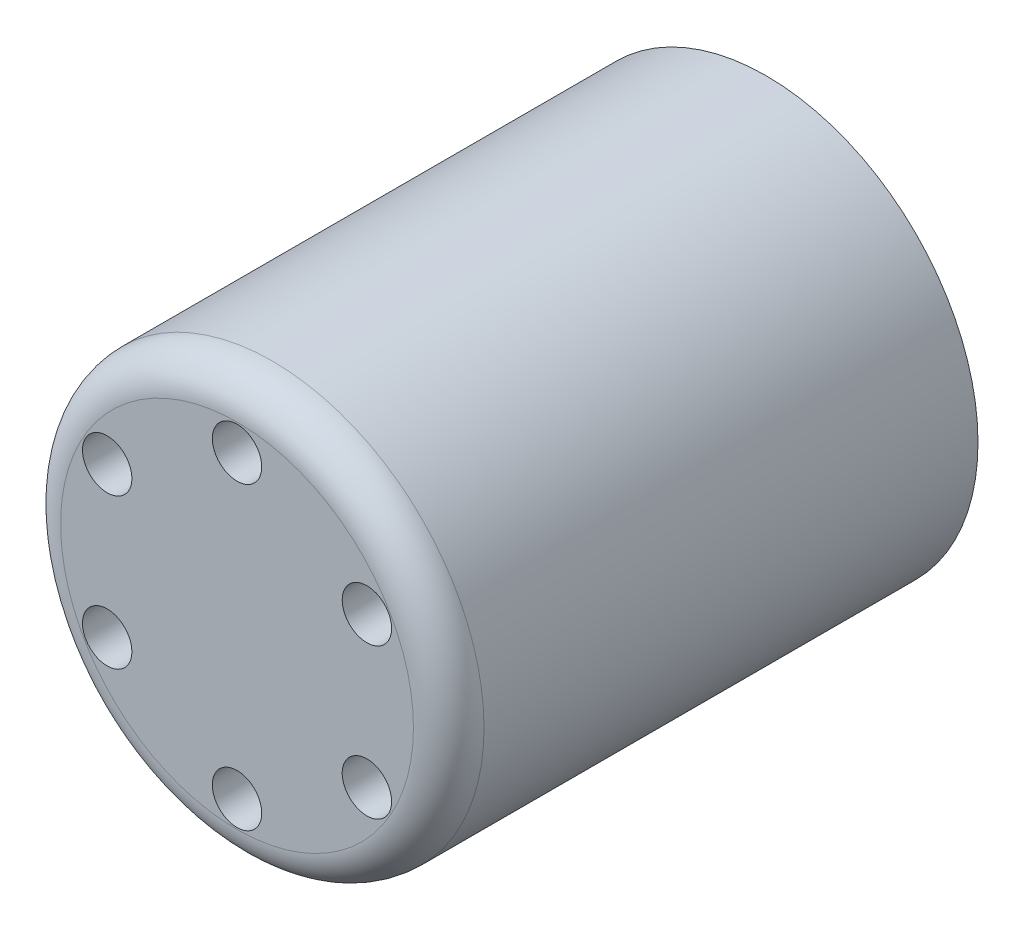
ISO-10303-21;
HEADER;
FILE_DESCRIPTION(('STEP AP214'),'2;1');
FILE_NAME('part.step','',(''),(''),'','','');
FILE_SCHEMA(('AUTOMOTIVE_DESIGN { 1 0 10303 214 1 1 1 1 }'));
ENDSEC;
DATA;
#1=APPLICATION_CONTEXT('core data for automotive mechanical design processes');
#2=APPLICATION_PROTOCOL_DEFINITION('international standard','automotive_design',2000,#1);
#3=PRODUCT_CONTEXT('',#1,'mechanical');
#4=PRODUCT('Part','Part','',(#3));
#5=PRODUCT_RELATED_PRODUCT_CATEGORY('part','',(#4));
#6=PRODUCT_DEFINITION_FORMATION('','',#4);
#7=PRODUCT_DEFINITION_CONTEXT('part definition',#1,'design');
#8=PRODUCT_DEFINITION('design','',#6,#7);
#9=PRODUCT_DEFINITION_SHAPE('','',#8);
#10=(LENGTH_UNIT() NAMED_UNIT(*) SI_UNIT(.MILLI.,.METRE.));
#11=(NAMED_UNIT(*) PLANE_ANGLE_UNIT() SI_UNIT($,.RADIAN.));
#12=(NAMED_UNIT(*) SI_UNIT($,.STERADIAN.) SOLID_ANGLE_UNIT());
#13=UNCERTAINTY_MEASURE_WITH_UNIT(LENGTH_MEASURE(1.E-05),#10,'distance_accuracy_value','');
#14=(GEOMETRIC_REPRESENTATION_CONTEXT(3) GLOBAL_UNCERTAINTY_ASSIGNED_CONTEXT((#13)) GLOBAL_UNIT_ASSIGNED_CONTEXT((#10,
#11,#12)) REPRESENTATION_CONTEXT('',''));
#15=CARTESIAN_POINT('',(0.,0.,0.));
#16=DIRECTION('',(0.,0.,1.));
#17=DIRECTION('',(1.,0.,0.));
#18=AXIS2_PLACEMENT_3D('',#15,#16,#17);
#19=CARTESIAN_POINT('',(0.,0.,15.));
#20=DIRECTION('',(0.,0.,-1.));
#21=DIRECTION('',(-1.,0.,0.));
#22=AXIS2_PLACEMENT_3D('',#19,#20,#21);
#23=CYLINDRICAL_SURFACE('',#22,6.);
#24=CARTESIAN_POINT('',(0.,0.,14.));
#25=DIRECTION('',(0.,0.,1.));
#26=DIRECTION('',(1.,0.,0.));
#27=AXIS2_PLACEMENT_3D('',#24,#25,#26);
#28=CIRCLE('',#27,6.);
#29=CARTESIAN_POINT('',(6.,0.,14.));
#30=VERTEX_POINT('',#29);
#31=EDGE_CURVE('E10',#30,#30,#28,.F.);
#32=ORIENTED_EDGE('',*,*,#31,.T.);
#33=EDGE_LOOP('',(#32));
#34=FACE_BOUND('',#33,.T.);
#35=CARTESIAN_POINT('',(0.,0.,0.));
#36=DIRECTION('',(0.,0.,1.));
#37=DIRECTION('',(1.,0.,0.));
#38=AXIS2_PLACEMENT_3D('',#35,#36,#37);
#39=CIRCLE('',#38,6.);
#40=CARTESIAN_POINT('',(6.,0.,0.));
#41=VERTEX_POINT('',#40);
#42=EDGE_CURVE('E42',#41,#41,#39,.T.);
#43=ORIENTED_EDGE('',*,*,#42,.T.);
#44=EDGE_LOOP('',(#43));
#45=FACE_BOUND('',#44,.T.);
#46=ADVANCED_FACE('F31',(#34,#45),#23,.T.);
#47=CARTESIAN_POINT('',(0.,0.,15.));
#48=DIRECTION('',(0.,0.,1.));
#49=DIRECTION('',(1.,0.,0.));
#50=AXIS2_PLACEMENT_3D('',#47,#48,#49);
#51=PLANE('',#50);
#52=CARTESIAN_POINT('',(0.,0.,15.));
#53=DIRECTION('',(0.,0.,1.));
#54=DIRECTION('',(1.,0.,0.));
#55=AXIS2_PLACEMENT_3D('',#52,#53,#54);
#56=CIRCLE('',#55,5.);
#57=CARTESIAN_POINT('',(5.,0.,15.));
#58=VERTEX_POINT('',#57);
#59=EDGE_CURVE('E38',#58,#58,#56,.T.);
#60=ORIENTED_EDGE('',*,*,#59,.T.);
#61=EDGE_LOOP('',(#60));
#62=FACE_BOUND('',#61,.T.);
#63=CARTESIAN_POINT('',(3.68060796608384,2.12500000000004,15.));
#64=DIRECTION('',(0.,0.,1.));
#65=DIRECTION('',(0.50000000000001,-0.866025403784433,0.));
#66=AXIS2_PLACEMENT_3D('',#63,#64,#65);
#67=CIRCLE('',#66,0.7);
#68=CARTESIAN_POINT('',(4.03060796608385,1.51878221735094,15.));
#69=VERTEX_POINT('',#68);
#70=EDGE_CURVE('E61',#69,#69,#67,.T.);
#71=ORIENTED_EDGE('',*,*,#70,.F.);
#72=EDGE_LOOP('',(#71));
#73=FACE_BOUND('',#72,.T.);
#74=CARTESIAN_POINT('',(3.68060796608388,-2.12499999999997,15.));
#75=DIRECTION('',(0.,0.,1.));
#76=DIRECTION('',(-0.499999999999992,-0.866025403784443,0.));
#77=AXIS2_PLACEMENT_3D('',#74,#75,#76);
#78=CIRCLE('',#77,0.7);
#79=CARTESIAN_POINT('',(3.33060796608389,-2.73121778264908,15.));
#80=VERTEX_POINT('',#79);
#81=EDGE_CURVE('E67',#80,#80,#78,.T.);
#82=ORIENTED_EDGE('',*,*,#81,.F.);
#83=EDGE_LOOP('',(#82));
#84=FACE_BOUND('',#83,.T.);
#85=CARTESIAN_POINT('',(0.,-4.25,15.));
#86=DIRECTION('',(0.,0.,1.));
#87=DIRECTION('',(-1.,0.,0.));
#88=AXIS2_PLACEMENT_3D('',#85,#86,#87);
#89=CIRCLE('',#88,0.7);
#90=CARTESIAN_POINT('',(-0.7,-4.25,15.));
#91=VERTEX_POINT('',#90);
#92=EDGE_CURVE('E73',#91,#91,#89,.T.);
#93=ORIENTED_EDGE('',*,*,#92,.F.);
#94=EDGE_LOOP('',(#93));
#95=FACE_BOUND('',#94,.T.);
#96=CARTESIAN_POINT('',(-3.68060796608386,-2.12500000000002,15.));
#97=DIRECTION('',(0.,0.,1.));
#98=DIRECTION('',(-0.500000000000004,0.866025403784436,0.));
#99=AXIS2_PLACEMENT_3D('',#96,#97,#98);
#100=CIRCLE('',#99,0.7);
#101=CARTESIAN_POINT('',(-4.03060796608386,-1.51878221735091,15.));
#102=VERTEX_POINT('',#101);
#103=EDGE_CURVE('E79',#102,#102,#100,.T.);
#104=ORIENTED_EDGE('',*,*,#103,.F.);
#105=EDGE_LOOP('',(#104));
#106=FACE_BOUND('',#105,.T.);
#107=CARTESIAN_POINT('',(-3.68060796608387,2.12499999999999,15.));
#108=DIRECTION('',(0.,0.,1.));
#109=DIRECTION('',(0.499999999999998,0.86602540378444,0.));
#110=AXIS2_PLACEMENT_3D('',#107,#108,#109);
#111=CIRCLE('',#110,0.7);
#112=CARTESIAN_POINT('',(-3.33060796608387,2.7312177826491,15.));
#113=VERTEX_POINT('',#112);
#114=EDGE_CURVE('E55',#113,#113,#111,.T.);
#115=ORIENTED_EDGE('',*,*,#114,.F.);
#116=EDGE_LOOP('',(#115));
#117=FACE_BOUND('',#116,.T.);
#118=CARTESIAN_POINT('',(0.,4.25,15.));
#119=DIRECTION('',(0.,0.,1.));
#120=DIRECTION('',(1.,0.,0.));
#121=AXIS2_PLACEMENT_3D('',#118,#119,#120);
#122=CIRCLE('',#121,0.7);
#123=CARTESIAN_POINT('',(0.7,4.25,15.));
#124=VERTEX_POINT('',#123);
#125=EDGE_CURVE('E49',#124,#124,#122,.T.);
#126=ORIENTED_EDGE('',*,*,#125,.F.);
#127=EDGE_LOOP('',(#126));
#128=FACE_BOUND('',#127,.T.);
#129=ADVANCED_FACE('F94',(#62,#73,#84,#95,#106,#117,#128),#51,.T.);
#130=CARTESIAN_POINT('',(0.,0.,0.));
#131=DIRECTION('',(0.,0.,1.));
#132=DIRECTION('',(1.,0.,0.));
#133=AXIS2_PLACEMENT_3D('',#130,#131,#132);
#134=PLANE('',#133);
#135=ORIENTED_EDGE('',*,*,#42,.F.);
#136=EDGE_LOOP('',(#135));
#137=FACE_BOUND('',#136,.T.);
#138=ADVANCED_FACE('F97',(#137),#134,.F.);
#139=CARTESIAN_POINT('',(0.,4.25,12.));
#140=DIRECTION('',(0.,0.,1.));
#141=DIRECTION('',(1.,0.,0.));
#142=AXIS2_PLACEMENT_3D('',#139,#140,#141);
#143=CYLINDRICAL_SURFACE('',#142,0.7);
#144=CARTESIAN_POINT('',(0.,4.25,12.));
#145=DIRECTION('',(0.,0.,1.));
#146=DIRECTION('',(1.,0.,0.));
#147=AXIS2_PLACEMENT_3D('',#144,#145,#146);
#148=CIRCLE('',#147,0.7);
#149=CARTESIAN_POINT('',(0.7,4.25,12.));
#150=VERTEX_POINT('',#149);
#151=EDGE_CURVE('E46',#150,#150,#148,.T.);
#152=ORIENTED_EDGE('',*,*,#151,.F.);
#153=EDGE_LOOP('',(#152));
#154=FACE_BOUND('',#153,.T.);
#155=ORIENTED_EDGE('',*,*,#125,.T.);
#156=EDGE_LOOP('',(#155));
#157=FACE_BOUND('',#156,.T.);
#158=ADVANCED_FACE('F103',(#154,#157),#143,.F.);
#159=CARTESIAN_POINT('',(0.,0.,12.));
#160=DIRECTION('',(0.,0.,1.));
#161=DIRECTION('',(1.,0.,0.));
#162=AXIS2_PLACEMENT_3D('',#159,#160,#161);
#163=PLANE('',#162);
#164=ORIENTED_EDGE('',*,*,#151,.T.);
#165=EDGE_LOOP('',(#164));
#166=FACE_BOUND('',#165,.T.);
#167=ADVANCED_FACE('F105',(#166),#163,.T.);
#168=CARTESIAN_POINT('',(-3.68060796608387,2.12499999999999,12.));
#169=DIRECTION('',(0.,0.,1.));
#170=DIRECTION('',(1.,0.,0.));
#171=AXIS2_PLACEMENT_3D('',#168,#169,#170);
#172=CYLINDRICAL_SURFACE('',#171,0.7);
#173=CARTESIAN_POINT('',(-3.68060796608387,2.12499999999999,12.));
#174=DIRECTION('',(0.,0.,1.));
#175=DIRECTION('',(0.499999999999998,0.86602540378444,0.));
#176=AXIS2_PLACEMENT_3D('',#173,#174,#175);
#177=CIRCLE('',#176,0.7);
#178=CARTESIAN_POINT('',(-3.33060796608387,2.7312177826491,12.));
#179=VERTEX_POINT('',#178);
#180=EDGE_CURVE('E52',#179,#179,#177,.T.);
#181=ORIENTED_EDGE('',*,*,#180,.F.);
#182=EDGE_LOOP('',(#181));
#183=FACE_BOUND('',#182,.T.);
#184=ORIENTED_EDGE('',*,*,#114,.T.);
#185=EDGE_LOOP('',(#184));
#186=FACE_BOUND('',#185,.T.);
#187=ADVANCED_FACE('F112',(#183,#186),#172,.F.);
#188=CARTESIAN_POINT('',(0.,0.,12.));
#189=DIRECTION('',(0.,0.,1.));
#190=DIRECTION('',(0.499999999999998,0.86602540378444,0.));
#191=AXIS2_PLACEMENT_3D('',#188,#189,#190);
#192=PLANE('',#191);
#193=ORIENTED_EDGE('',*,*,#180,.T.);
#194=EDGE_LOOP('',(#193));
#195=FACE_BOUND('',#194,.T.);
#196=ADVANCED_FACE('F90',(#195),#192,.T.);
#197=CARTESIAN_POINT('',(-3.68060796608386,-2.12500000000002,12.));
#198=DIRECTION('',(0.,0.,1.));
#199=DIRECTION('',(1.,0.,0.));
#200=AXIS2_PLACEMENT_3D('',#197,#198,#199);
#201=CYLINDRICAL_SURFACE('',#200,0.7);
#202=CARTESIAN_POINT('',(-3.68060796608386,-2.12500000000002,12.));
#203=DIRECTION('',(0.,0.,1.));
#204=DIRECTION('',(-0.500000000000004,0.866025403784436,0.));
#205=AXIS2_PLACEMENT_3D('',#202,#203,#204);
#206=CIRCLE('',#205,0.7);
#207=CARTESIAN_POINT('',(-4.03060796608386,-1.51878221735091,12.));
#208=VERTEX_POINT('',#207);
#209=EDGE_CURVE('E58',#208,#208,#206,.T.);
#210=ORIENTED_EDGE('',*,*,#209,.F.);
#211=EDGE_LOOP('',(#210));
#212=FACE_BOUND('',#211,.T.);
#213=ORIENTED_EDGE('',*,*,#103,.T.);
#214=EDGE_LOOP('',(#213));
#215=FACE_BOUND('',#214,.T.);
#216=ADVANCED_FACE('F87',(#212,#215),#201,.F.);
#217=CARTESIAN_POINT('',(0.,0.,12.));
#218=DIRECTION('',(0.,0.,1.));
#219=DIRECTION('',(-0.500000000000004,0.866025403784436,0.));
#220=AXIS2_PLACEMENT_3D('',#217,#218,#219);
#221=PLANE('',#220);
#222=ORIENTED_EDGE('',*,*,#209,.T.);
#223=EDGE_LOOP('',(#222));
#224=FACE_BOUND('',#223,.T.);
#225=ADVANCED_FACE('F85',(#224),#221,.T.);
#226=CARTESIAN_POINT('',(0.,-4.25,12.));
#227=DIRECTION('',(0.,0.,1.));
#228=DIRECTION('',(1.,0.,0.));
#229=AXIS2_PLACEMENT_3D('',#226,#227,#228);
#230=CYLINDRICAL_SURFACE('',#229,0.7);
#231=CARTESIAN_POINT('',(0.,-4.25,12.));
#232=DIRECTION('',(0.,0.,1.));
#233=DIRECTION('',(-1.,0.,0.));
#234=AXIS2_PLACEMENT_3D('',#231,#232,#233);
#235=CIRCLE('',#234,0.7);
#236=CARTESIAN_POINT('',(-0.7,-4.25,12.));
#237=VERTEX_POINT('',#236);
#238=EDGE_CURVE('E76',#237,#237,#235,.T.);
#239=ORIENTED_EDGE('',*,*,#238,.F.);
#240=EDGE_LOOP('',(#239));
#241=FACE_BOUND('',#240,.T.);
#242=ORIENTED_EDGE('',*,*,#92,.T.);
#243=EDGE_LOOP('',(#242));
#244=FACE_BOUND('',#243,.T.);
#245=ADVANCED_FACE('F179',(#241,#244),#230,.F.);
#246=CARTESIAN_POINT('',(0.,0.,12.));
#247=DIRECTION('',(0.,0.,1.));
#248=DIRECTION('',(-1.,0.,0.));
#249=AXIS2_PLACEMENT_3D('',#246,#247,#248);
#250=PLANE('',#249);
#251=ORIENTED_EDGE('',*,*,#238,.T.);
#252=EDGE_LOOP('',(#251));
#253=FACE_BOUND('',#252,.T.);
#254=ADVANCED_FACE('F188',(#253),#250,.T.);
#255=CARTESIAN_POINT('',(3.68060796608388,-2.12499999999997,12.));
#256=DIRECTION('',(0.,0.,1.));
#257=DIRECTION('',(1.,0.,0.));
#258=AXIS2_PLACEMENT_3D('',#255,#256,#257);
#259=CYLINDRICAL_SURFACE('',#258,0.7);
#260=CARTESIAN_POINT('',(3.68060796608388,-2.12499999999997,12.));
#261=DIRECTION('',(0.,0.,1.));
#262=DIRECTION('',(-0.499999999999992,-0.866025403784443,0.));
#263=AXIS2_PLACEMENT_3D('',#260,#261,#262);
#264=CIRCLE('',#263,0.7);
#265=CARTESIAN_POINT('',(3.33060796608389,-2.73121778264908,12.));
#266=VERTEX_POINT('',#265);
#267=EDGE_CURVE('E70',#266,#266,#264,.T.);
#268=ORIENTED_EDGE('',*,*,#267,.F.);
#269=EDGE_LOOP('',(#268));
#270=FACE_BOUND('',#269,.T.);
#271=ORIENTED_EDGE('',*,*,#81,.T.);
#272=EDGE_LOOP('',(#271));
#273=FACE_BOUND('',#272,.T.);
#274=ADVANCED_FACE('F199',(#270,#273),#259,.F.);
#275=CARTESIAN_POINT('',(0.,0.,12.));
#276=DIRECTION('',(0.,0.,1.));
#277=DIRECTION('',(-0.499999999999992,-0.866025403784443,0.));
#278=AXIS2_PLACEMENT_3D('',#275,#276,#277);
#279=PLANE('',#278);
#280=ORIENTED_EDGE('',*,*,#267,.T.);
#281=EDGE_LOOP('',(#280));
#282=FACE_BOUND('',#281,.T.);
#283=ADVANCED_FACE('F209',(#282),#279,.T.);
#284=CARTESIAN_POINT('',(3.68060796608384,2.12500000000004,12.));
#285=DIRECTION('',(0.,0.,1.));
#286=DIRECTION('',(1.,0.,0.));
#287=AXIS2_PLACEMENT_3D('',#284,#285,#286);
#288=CYLINDRICAL_SURFACE('',#287,0.7);
#289=CARTESIAN_POINT('',(3.68060796608384,2.12500000000004,12.));
#290=DIRECTION('',(0.,0.,1.));
#291=DIRECTION('',(0.50000000000001,-0.866025403784433,0.));
#292=AXIS2_PLACEMENT_3D('',#289,#290,#291);
#293=CIRCLE('',#292,0.7);
#294=CARTESIAN_POINT('',(4.03060796608385,1.51878221735094,12.));
#295=VERTEX_POINT('',#294);
#296=EDGE_CURVE('E64',#295,#295,#293,.T.);
#297=ORIENTED_EDGE('',*,*,#296,.F.);
#298=EDGE_LOOP('',(#297));
#299=FACE_BOUND('',#298,.T.);
#300=ORIENTED_EDGE('',*,*,#70,.T.);
#301=EDGE_LOOP('',(#300));
#302=FACE_BOUND('',#301,.T.);
#303=ADVANCED_FACE('F220',(#299,#302),#288,.F.);
#304=CARTESIAN_POINT('',(0.,0.,12.));
#305=DIRECTION('',(0.,0.,1.));
#306=DIRECTION('',(0.50000000000001,-0.866025403784433,0.));
#307=AXIS2_PLACEMENT_3D('',#304,#305,#306);
#308=PLANE('',#307);
#309=ORIENTED_EDGE('',*,*,#296,.T.);
#310=EDGE_LOOP('',(#309));
#311=FACE_BOUND('',#310,.T.);
#312=ADVANCED_FACE('F229',(#311),#308,.T.);
#313=CARTESIAN_POINT('',(0.,0.,14.));
#314=DIRECTION('',(0.,0.,1.));
#315=DIRECTION('',(1.,0.,0.));
#316=AXIS2_PLACEMENT_3D('',#313,#314,#315);
#317=TOROIDAL_SURFACE('',#316,5.,1.);
#318=ORIENTED_EDGE('',*,*,#31,.F.);
#319=EDGE_LOOP('',(#318));
#320=FACE_BOUND('',#319,.T.);
#321=ORIENTED_EDGE('',*,*,#59,.F.);
#322=EDGE_LOOP('',(#321));
#323=FACE_BOUND('',#322,.T.);
#324=ADVANCED_FACE('F33',(#320,#323),#317,.T.);
#325=CLOSED_SHELL('',(#46,#129,#138,#158,#167,#187,#196,#216,#225,#245,#254,#274,#283,#303,#312,#324));
#326=MANIFOLD_SOLID_BREP('B2',#325);
#327=ADVANCED_BREP_SHAPE_REPRESENTATION('',(#18,#326),#14);
#328=SHAPE_DEFINITION_REPRESENTATION(#9,#327);
ENDSEC;
END-ISO-10303-21;
